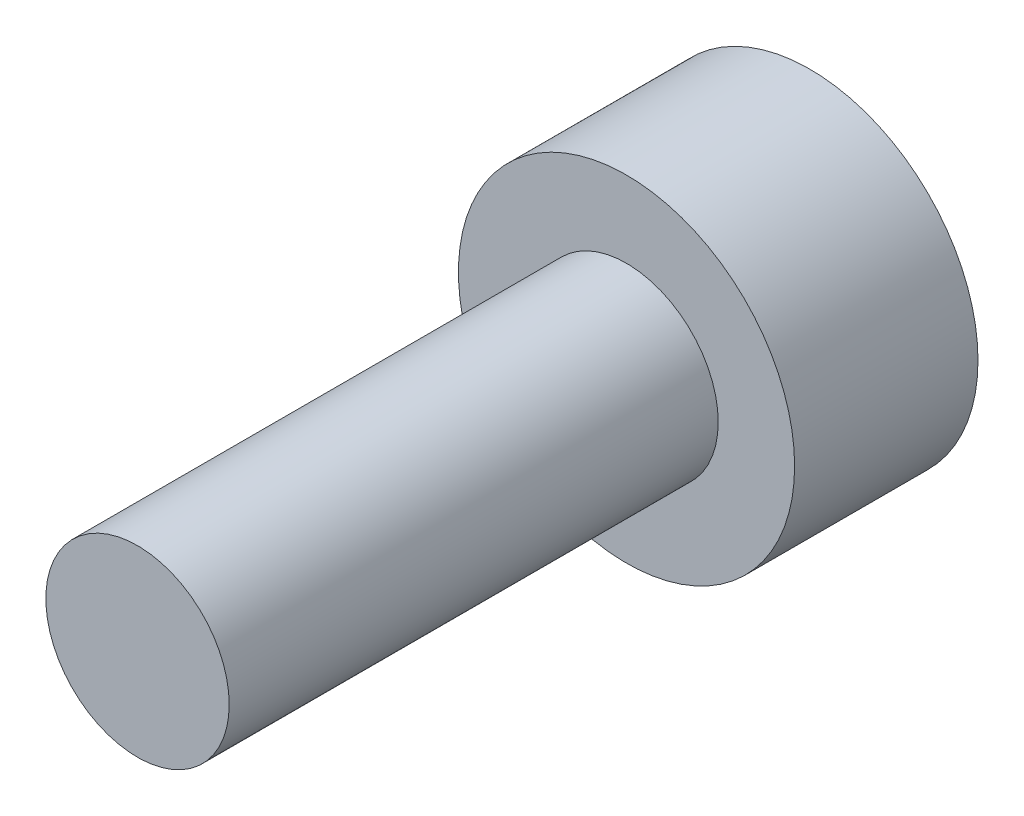
ISO-10303-21;
HEADER;
FILE_DESCRIPTION(('STEP AP214'),'2;1');
FILE_NAME('part.step','',(''),(''),'','','');
FILE_SCHEMA(('AUTOMOTIVE_DESIGN { 1 0 10303 214 1 1 1 1 }'));
ENDSEC;
DATA;
#1=APPLICATION_CONTEXT('core data for automotive mechanical design processes');
#2=APPLICATION_PROTOCOL_DEFINITION('international standard','automotive_design',2000,#1);
#3=PRODUCT_CONTEXT('',#1,'mechanical');
#4=PRODUCT('Part','Part','',(#3));
#5=PRODUCT_RELATED_PRODUCT_CATEGORY('part','',(#4));
#6=PRODUCT_DEFINITION_FORMATION('','',#4);
#7=PRODUCT_DEFINITION_CONTEXT('part definition',#1,'design');
#8=PRODUCT_DEFINITION('design','',#6,#7);
#9=PRODUCT_DEFINITION_SHAPE('','',#8);
#10=(LENGTH_UNIT() NAMED_UNIT(*) SI_UNIT(.MILLI.,.METRE.));
#11=(NAMED_UNIT(*) PLANE_ANGLE_UNIT() SI_UNIT($,.RADIAN.));
#12=(NAMED_UNIT(*) SI_UNIT($,.STERADIAN.) SOLID_ANGLE_UNIT());
#13=UNCERTAINTY_MEASURE_WITH_UNIT(LENGTH_MEASURE(1.E-05),#10,'distance_accuracy_value','');
#14=(GEOMETRIC_REPRESENTATION_CONTEXT(3) GLOBAL_UNCERTAINTY_ASSIGNED_CONTEXT((#13)) GLOBAL_UNIT_ASSIGNED_CONTEXT((#10,
#11,#12)) REPRESENTATION_CONTEXT('',''));
#15=CARTESIAN_POINT('',(0.,0.,0.));
#16=DIRECTION('',(0.,0.,1.));
#17=DIRECTION('',(1.,0.,0.));
#18=AXIS2_PLACEMENT_3D('',#15,#16,#17);
#19=CARTESIAN_POINT('',(0.,0.,3.));
#20=DIRECTION('',(0.,0.,-1.));
#21=DIRECTION('',(-1.,0.,0.));
#22=AXIS2_PLACEMENT_3D('',#19,#20,#21);
#23=CYLINDRICAL_SURFACE('',#22,2.75);
#24=CARTESIAN_POINT('',(0.,0.,3.));
#25=DIRECTION('',(0.,0.,1.));
#26=DIRECTION('',(1.,0.,0.));
#27=AXIS2_PLACEMENT_3D('',#24,#25,#26);
#28=CIRCLE('',#27,2.75);
#29=CARTESIAN_POINT('',(2.75,0.,3.));
#30=VERTEX_POINT('',#29);
#31=EDGE_CURVE('E44',#30,#30,#28,.T.);
#32=ORIENTED_EDGE('',*,*,#31,.F.);
#33=EDGE_LOOP('',(#32));
#34=FACE_BOUND('',#33,.T.);
#35=CARTESIAN_POINT('',(0.,0.,0.));
#36=DIRECTION('',(0.,0.,1.));
#37=DIRECTION('',(1.,0.,0.));
#38=AXIS2_PLACEMENT_3D('',#35,#36,#37);
#39=CIRCLE('',#38,2.75);
#40=CARTESIAN_POINT('',(2.75,0.,0.));
#41=VERTEX_POINT('',#40);
#42=EDGE_CURVE('E39',#41,#41,#39,.T.);
#43=ORIENTED_EDGE('',*,*,#42,.T.);
#44=EDGE_LOOP('',(#43));
#45=FACE_BOUND('',#44,.T.);
#46=ADVANCED_FACE('F36',(#34,#45),#23,.T.);
#47=CARTESIAN_POINT('',(0.,0.,3.));
#48=DIRECTION('',(0.,0.,1.));
#49=DIRECTION('',(1.,0.,0.));
#50=AXIS2_PLACEMENT_3D('',#47,#48,#49);
#51=PLANE('',#50);
#52=CARTESIAN_POINT('',(0.,0.,3.));
#53=DIRECTION('',(0.,0.,1.));
#54=DIRECTION('',(1.,0.,0.));
#55=AXIS2_PLACEMENT_3D('',#52,#53,#54);
#56=CIRCLE('',#55,1.5);
#57=CARTESIAN_POINT('',(1.5,0.,3.));
#58=VERTEX_POINT('',#57);
#59=EDGE_CURVE('E11',#58,#58,#56,.T.);
#60=ORIENTED_EDGE('',*,*,#59,.F.);
#61=EDGE_LOOP('',(#60));
#62=FACE_BOUND('',#61,.T.);
#63=ORIENTED_EDGE('',*,*,#31,.T.);
#64=EDGE_LOOP('',(#63));
#65=FACE_BOUND('',#64,.T.);
#66=ADVANCED_FACE('F154',(#62,#65),#51,.T.);
#67=CARTESIAN_POINT('',(0.,0.,0.));
#68=DIRECTION('',(0.,0.,1.));
#69=DIRECTION('',(1.,0.,0.));
#70=AXIS2_PLACEMENT_3D('',#67,#68,#69);
#71=PLANE('',#70);
#72=DIRECTION('',(-0.866025403784439,-0.5,0.));
#73=VECTOR('',#72,1.);
#74=CARTESIAN_POINT('',(0.625,-1.08253175473055,0.));
#75=LINE('',#74,#73);
#76=CARTESIAN_POINT('',(1.25,-0.721687836487032,0.));
#77=VERTEX_POINT('',#76);
#78=CARTESIAN_POINT('',(0.,-1.44337567297406,0.));
#79=VERTEX_POINT('',#78);
#80=EDGE_CURVE('E126',#77,#79,#75,.T.);
#81=ORIENTED_EDGE('',*,*,#80,.F.);
#82=DIRECTION('',(0.,-1.,0.));
#83=VECTOR('',#82,1.);
#84=CARTESIAN_POINT('',(1.25,0.,0.));
#85=LINE('',#84,#83);
#86=CARTESIAN_POINT('',(1.25,0.721687836487033,0.));
#87=VERTEX_POINT('',#86);
#88=EDGE_CURVE('E52',#87,#77,#85,.T.);
#89=ORIENTED_EDGE('',*,*,#88,.F.);
#90=DIRECTION('',(0.866025403784439,-0.5,0.));
#91=VECTOR('',#90,1.);
#92=CARTESIAN_POINT('',(0.625000000000001,1.08253175473055,0.));
#93=LINE('',#92,#91);
#94=CARTESIAN_POINT('',(0.,1.44337567297407,0.));
#95=VERTEX_POINT('',#94);
#96=EDGE_CURVE('E136',#95,#87,#93,.T.);
#97=ORIENTED_EDGE('',*,*,#96,.F.);
#98=DIRECTION('',(0.866025403784439,0.5,0.));
#99=VECTOR('',#98,1.);
#100=CARTESIAN_POINT('',(-0.625,1.08253175473055,0.));
#101=LINE('',#100,#99);
#102=CARTESIAN_POINT('',(-1.25,0.721687836487033,0.));
#103=VERTEX_POINT('',#102);
#104=EDGE_CURVE('E134',#103,#95,#101,.T.);
#105=ORIENTED_EDGE('',*,*,#104,.F.);
#106=DIRECTION('',(0.,1.,0.));
#107=VECTOR('',#106,1.);
#108=CARTESIAN_POINT('',(-1.25,0.,0.));
#109=LINE('',#108,#107);
#110=CARTESIAN_POINT('',(-1.25,-0.721687836487032,0.));
#111=VERTEX_POINT('',#110);
#112=EDGE_CURVE('E100',#111,#103,#109,.T.);
#113=ORIENTED_EDGE('',*,*,#112,.F.);
#114=DIRECTION('',(-0.866025403784439,0.5,0.));
#115=VECTOR('',#114,1.);
#116=CARTESIAN_POINT('',(-0.625,-1.08253175473055,0.));
#117=LINE('',#116,#115);
#118=EDGE_CURVE('E130',#79,#111,#117,.T.);
#119=ORIENTED_EDGE('',*,*,#118,.F.);
#120=EDGE_LOOP('',(#81,#89,#97,#105,#113,#119));
#121=FACE_BOUND('',#120,.T.);
#122=ORIENTED_EDGE('',*,*,#42,.F.);
#123=EDGE_LOOP('',(#122));
#124=FACE_BOUND('',#123,.T.);
#125=ADVANCED_FACE('F151',(#121,#124),#71,.F.);
#126=CARTESIAN_POINT('',(1.25,0.,1.3));
#127=DIRECTION('',(1.,0.,0.));
#128=DIRECTION('',(0.,1.,0.));
#129=AXIS2_PLACEMENT_3D('',#126,#127,#128);
#130=PLANE('',#129);
#131=ORIENTED_EDGE('',*,*,#88,.T.);
#132=DIRECTION('',(0.,0.,-1.));
#133=VECTOR('',#132,1.);
#134=CARTESIAN_POINT('',(1.25,-0.721687836487032,1.3));
#135=LINE('',#134,#133);
#136=CARTESIAN_POINT('',(1.25,-0.721687836487032,1.3));
#137=VERTEX_POINT('',#136);
#138=EDGE_CURVE('E82',#137,#77,#135,.T.);
#139=ORIENTED_EDGE('',*,*,#138,.F.);
#140=DIRECTION('',(0.,-1.,0.));
#141=VECTOR('',#140,1.);
#142=CARTESIAN_POINT('',(1.25,0.,1.3));
#143=LINE('',#142,#141);
#144=CARTESIAN_POINT('',(1.25,0.721687836487033,1.3));
#145=VERTEX_POINT('',#144);
#146=EDGE_CURVE('E138',#145,#137,#143,.T.);
#147=ORIENTED_EDGE('',*,*,#146,.F.);
#148=DIRECTION('',(0.,0.,-1.));
#149=VECTOR('',#148,1.);
#150=CARTESIAN_POINT('',(1.25,0.721687836487033,1.3));
#151=LINE('',#150,#149);
#152=EDGE_CURVE('E60',#145,#87,#151,.T.);
#153=ORIENTED_EDGE('',*,*,#152,.T.);
#154=EDGE_LOOP('',(#131,#139,#147,#153));
#155=FACE_BOUND('',#154,.T.);
#156=ADVANCED_FACE('F153',(#155),#130,.F.);
#157=CARTESIAN_POINT('',(0.625000000000001,1.08253175473055,1.3));
#158=DIRECTION('',(0.5,0.866025403784439,0.));
#159=DIRECTION('',(-0.866025403784439,0.5,0.));
#160=AXIS2_PLACEMENT_3D('',#157,#158,#159);
#161=PLANE('',#160);
#162=ORIENTED_EDGE('',*,*,#96,.T.);
#163=ORIENTED_EDGE('',*,*,#152,.F.);
#164=DIRECTION('',(0.866025403784439,-0.5,0.));
#165=VECTOR('',#164,1.);
#166=CARTESIAN_POINT('',(0.625000000000001,1.08253175473055,1.3));
#167=LINE('',#166,#165);
#168=CARTESIAN_POINT('',(0.,1.44337567297407,1.3));
#169=VERTEX_POINT('',#168);
#170=EDGE_CURVE('E112',#169,#145,#167,.T.);
#171=ORIENTED_EDGE('',*,*,#170,.F.);
#172=DIRECTION('',(0.,0.,-1.));
#173=VECTOR('',#172,1.);
#174=CARTESIAN_POINT('',(0.,1.44337567297407,1.3));
#175=LINE('',#174,#173);
#176=EDGE_CURVE('E104',#169,#95,#175,.T.);
#177=ORIENTED_EDGE('',*,*,#176,.T.);
#178=EDGE_LOOP('',(#162,#163,#171,#177));
#179=FACE_BOUND('',#178,.T.);
#180=ADVANCED_FACE('F160',(#179),#161,.F.);
#181=CARTESIAN_POINT('',(-0.625,1.08253175473055,1.3));
#182=DIRECTION('',(-0.5,0.866025403784439,0.));
#183=DIRECTION('',(-0.866025403784439,-0.5,0.));
#184=AXIS2_PLACEMENT_3D('',#181,#182,#183);
#185=PLANE('',#184);
#186=ORIENTED_EDGE('',*,*,#104,.T.);
#187=ORIENTED_EDGE('',*,*,#176,.F.);
#188=DIRECTION('',(0.866025403784439,0.5,0.));
#189=VECTOR('',#188,1.);
#190=CARTESIAN_POINT('',(-0.625,1.08253175473055,1.3));
#191=LINE('',#190,#189);
#192=CARTESIAN_POINT('',(-1.25,0.721687836487033,1.3));
#193=VERTEX_POINT('',#192);
#194=EDGE_CURVE('E108',#193,#169,#191,.T.);
#195=ORIENTED_EDGE('',*,*,#194,.F.);
#196=DIRECTION('',(0.,0.,-1.));
#197=VECTOR('',#196,1.);
#198=CARTESIAN_POINT('',(-1.25,0.721687836487033,1.3));
#199=LINE('',#198,#197);
#200=EDGE_CURVE('E93',#193,#103,#199,.T.);
#201=ORIENTED_EDGE('',*,*,#200,.T.);
#202=EDGE_LOOP('',(#186,#187,#195,#201));
#203=FACE_BOUND('',#202,.T.);
#204=ADVANCED_FACE('F109',(#203),#185,.F.);
#205=CARTESIAN_POINT('',(-1.25,0.,1.3));
#206=DIRECTION('',(-1.,0.,0.));
#207=DIRECTION('',(0.,-1.,0.));
#208=AXIS2_PLACEMENT_3D('',#205,#206,#207);
#209=PLANE('',#208);
#210=ORIENTED_EDGE('',*,*,#112,.T.);
#211=ORIENTED_EDGE('',*,*,#200,.F.);
#212=DIRECTION('',(0.,1.,0.));
#213=VECTOR('',#212,1.);
#214=CARTESIAN_POINT('',(-1.25,0.,1.3));
#215=LINE('',#214,#213);
#216=CARTESIAN_POINT('',(-1.25,-0.721687836487032,1.3));
#217=VERTEX_POINT('',#216);
#218=EDGE_CURVE('E97',#217,#193,#215,.T.);
#219=ORIENTED_EDGE('',*,*,#218,.F.);
#220=DIRECTION('',(0.,0.,-1.));
#221=VECTOR('',#220,1.);
#222=CARTESIAN_POINT('',(-1.25,-0.721687836487032,1.3));
#223=LINE('',#222,#221);
#224=EDGE_CURVE('E105',#217,#111,#223,.T.);
#225=ORIENTED_EDGE('',*,*,#224,.T.);
#226=EDGE_LOOP('',(#210,#211,#219,#225));
#227=FACE_BOUND('',#226,.T.);
#228=ADVANCED_FACE('F95',(#227),#209,.F.);
#229=CARTESIAN_POINT('',(-0.625,-1.08253175473055,1.3));
#230=DIRECTION('',(-0.5,-0.866025403784439,0.));
#231=DIRECTION('',(0.866025403784439,-0.5,0.));
#232=AXIS2_PLACEMENT_3D('',#229,#230,#231);
#233=PLANE('',#232);
#234=ORIENTED_EDGE('',*,*,#118,.T.);
#235=ORIENTED_EDGE('',*,*,#224,.F.);
#236=DIRECTION('',(-0.866025403784439,0.5,0.));
#237=VECTOR('',#236,1.);
#238=CARTESIAN_POINT('',(-0.625,-1.08253175473055,1.3));
#239=LINE('',#238,#237);
#240=CARTESIAN_POINT('',(0.,-1.44337567297406,1.3));
#241=VERTEX_POINT('',#240);
#242=EDGE_CURVE('E118',#241,#217,#239,.T.);
#243=ORIENTED_EDGE('',*,*,#242,.F.);
#244=DIRECTION('',(0.,0.,-1.));
#245=VECTOR('',#244,1.);
#246=CARTESIAN_POINT('',(0.,-1.44337567297406,1.3));
#247=LINE('',#246,#245);
#248=EDGE_CURVE('E142',#241,#79,#247,.T.);
#249=ORIENTED_EDGE('',*,*,#248,.T.);
#250=EDGE_LOOP('',(#234,#235,#243,#249));
#251=FACE_BOUND('',#250,.T.);
#252=ADVANCED_FACE('F213',(#251),#233,.F.);
#253=CARTESIAN_POINT('',(0.625,-1.08253175473055,1.3));
#254=DIRECTION('',(0.5,-0.866025403784439,0.));
#255=DIRECTION('',(0.866025403784439,0.5,0.));
#256=AXIS2_PLACEMENT_3D('',#253,#254,#255);
#257=PLANE('',#256);
#258=ORIENTED_EDGE('',*,*,#80,.T.);
#259=ORIENTED_EDGE('',*,*,#248,.F.);
#260=DIRECTION('',(-0.866025403784439,-0.5,0.));
#261=VECTOR('',#260,1.);
#262=CARTESIAN_POINT('',(0.625,-1.08253175473055,1.3));
#263=LINE('',#262,#261);
#264=EDGE_CURVE('E120',#137,#241,#263,.T.);
#265=ORIENTED_EDGE('',*,*,#264,.F.);
#266=ORIENTED_EDGE('',*,*,#138,.T.);
#267=EDGE_LOOP('',(#258,#259,#265,#266));
#268=FACE_BOUND('',#267,.T.);
#269=ADVANCED_FACE('F206',(#268),#257,.F.);
#270=CARTESIAN_POINT('',(0.,0.,1.3));
#271=DIRECTION('',(0.,0.,-1.));
#272=DIRECTION('',(-1.,0.,0.));
#273=AXIS2_PLACEMENT_3D('',#270,#271,#272);
#274=PLANE('',#273);
#275=ORIENTED_EDGE('',*,*,#146,.T.);
#276=ORIENTED_EDGE('',*,*,#264,.T.);
#277=ORIENTED_EDGE('',*,*,#242,.T.);
#278=ORIENTED_EDGE('',*,*,#218,.T.);
#279=ORIENTED_EDGE('',*,*,#194,.T.);
#280=ORIENTED_EDGE('',*,*,#170,.T.);
#281=EDGE_LOOP('',(#275,#276,#277,#278,#279,#280));
#282=FACE_BOUND('',#281,.T.);
#283=ADVANCED_FACE('F115',(#282),#274,.T.);
#284=CARTESIAN_POINT('',(0.,0.,11.));
#285=DIRECTION('',(0.,0.,-1.));
#286=DIRECTION('',(-1.,0.,0.));
#287=AXIS2_PLACEMENT_3D('',#284,#285,#286);
#288=CYLINDRICAL_SURFACE('',#287,1.5);
#289=CARTESIAN_POINT('',(0.,0.,11.));
#290=DIRECTION('',(0.,0.,1.));
#291=DIRECTION('',(1.,0.,0.));
#292=AXIS2_PLACEMENT_3D('',#289,#290,#291);
#293=CIRCLE('',#292,1.5);
#294=CARTESIAN_POINT('',(1.5,0.,11.));
#295=VERTEX_POINT('',#294);
#296=EDGE_CURVE('E127',#295,#295,#293,.T.);
#297=ORIENTED_EDGE('',*,*,#296,.F.);
#298=EDGE_LOOP('',(#297));
#299=FACE_BOUND('',#298,.T.);
#300=ORIENTED_EDGE('',*,*,#59,.T.);
#301=EDGE_LOOP('',(#300));
#302=FACE_BOUND('',#301,.T.);
#303=ADVANCED_FACE('F184',(#299,#302),#288,.T.);
#304=CARTESIAN_POINT('',(0.,0.,11.));
#305=DIRECTION('',(0.,0.,1.));
#306=DIRECTION('',(1.,0.,0.));
#307=AXIS2_PLACEMENT_3D('',#304,#305,#306);
#308=PLANE('',#307);
#309=ORIENTED_EDGE('',*,*,#296,.T.);
#310=EDGE_LOOP('',(#309));
#311=FACE_BOUND('',#310,.T.);
#312=ADVANCED_FACE('F189',(#311),#308,.T.);
#313=CLOSED_SHELL('',(#46,#66,#125,#156,#180,#204,#228,#252,#269,#283,#303,#312));
#314=MANIFOLD_SOLID_BREP('B2',#313);
#315=ADVANCED_BREP_SHAPE_REPRESENTATION('',(#18,#314),#14);
#316=SHAPE_DEFINITION_REPRESENTATION(#9,#315);
ENDSEC;
END-ISO-10303-21;
